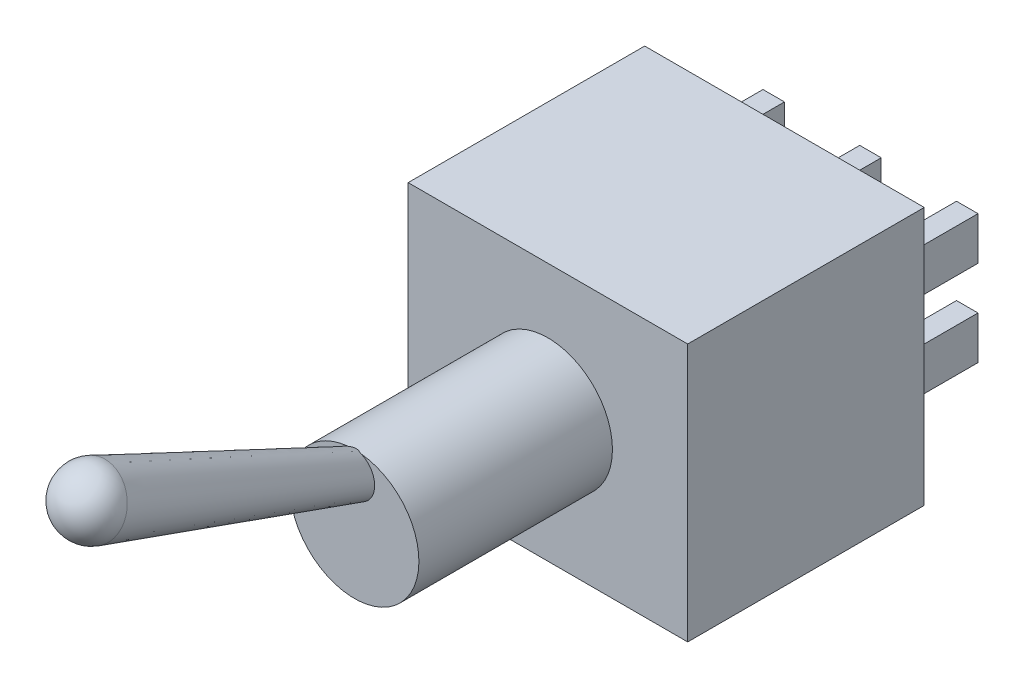
ISO-10303-21;
HEADER;
FILE_DESCRIPTION(('STEP AP214'),'2;1');
FILE_NAME('part.step','',(''),(''),'','','');
FILE_SCHEMA(('AUTOMOTIVE_DESIGN { 1 0 10303 214 1 1 1 1 }'));
ENDSEC;
DATA;
#1=APPLICATION_CONTEXT('core data for automotive mechanical design processes');
#2=APPLICATION_PROTOCOL_DEFINITION('international standard','automotive_design',2000,#1);
#3=PRODUCT_CONTEXT('',#1,'mechanical');
#4=PRODUCT('Part','Part','',(#3));
#5=PRODUCT_RELATED_PRODUCT_CATEGORY('part','',(#4));
#6=PRODUCT_DEFINITION_FORMATION('','',#4);
#7=PRODUCT_DEFINITION_CONTEXT('part definition',#1,'design');
#8=PRODUCT_DEFINITION('design','',#6,#7);
#9=PRODUCT_DEFINITION_SHAPE('','',#8);
#10=(LENGTH_UNIT() NAMED_UNIT(*) SI_UNIT(.MILLI.,.METRE.));
#11=(NAMED_UNIT(*) PLANE_ANGLE_UNIT() SI_UNIT($,.RADIAN.));
#12=(NAMED_UNIT(*) SI_UNIT($,.STERADIAN.) SOLID_ANGLE_UNIT());
#13=UNCERTAINTY_MEASURE_WITH_UNIT(LENGTH_MEASURE(1.E-05),#10,'distance_accuracy_value','');
#14=(GEOMETRIC_REPRESENTATION_CONTEXT(3) GLOBAL_UNCERTAINTY_ASSIGNED_CONTEXT((#13)) GLOBAL_UNIT_ASSIGNED_CONTEXT((#10,
#11,#12)) REPRESENTATION_CONTEXT('',''));
#15=CARTESIAN_POINT('',(0.,0.,0.));
#16=DIRECTION('',(0.,0.,1.));
#17=DIRECTION('',(1.,0.,0.));
#18=AXIS2_PLACEMENT_3D('',#15,#16,#17);
#19=CARTESIAN_POINT('',(-6.5,6.,20.));
#20=DIRECTION('',(0.,0.,-1.));
#21=DIRECTION('',(-1.,0.,0.));
#22=AXIS2_PLACEMENT_3D('',#19,#20,#21);
#23=CYLINDRICAL_SURFACE('',#22,3.);
#24=CARTESIAN_POINT('',(-6.5,6.,11.));
#25=DIRECTION('',(0.,0.,1.));
#26=DIRECTION('',(1.,0.,0.));
#27=AXIS2_PLACEMENT_3D('',#24,#25,#26);
#28=CIRCLE('',#27,3.);
#29=CARTESIAN_POINT('',(-3.5,6.,11.));
#30=VERTEX_POINT('',#29);
#31=EDGE_CURVE('E54',#30,#30,#28,.T.);
#32=ORIENTED_EDGE('',*,*,#31,.T.);
#33=EDGE_LOOP('',(#32));
#34=FACE_BOUND('',#33,.T.);
#35=CARTESIAN_POINT('',(-6.20878339732208,8.98583202647516,20.0002));
#36=CARTESIAN_POINT('',(-6.23815934190393,8.9887111729365,19.9840793561173));
#37=CARTESIAN_POINT('',(-6.26884043857984,8.99125246053167,19.9700978413456));
#38=CARTESIAN_POINT('',(-6.33201689326537,8.99545658639469,19.9471941532919));
#39=CARTESIAN_POINT('',(-6.36450889953132,8.99712099161466,19.9382629531998));
#40=CARTESIAN_POINT('',(-6.43082244543025,8.9993872261203,19.9261410543836));
#41=CARTESIAN_POINT('',(-6.46465085856817,8.99998254377956,19.9229855320874));
#42=CARTESIAN_POINT('',(-6.53232526809802,9.00001669423725,19.9228040432445));
#43=CARTESIAN_POINT('',(-6.5661712647041,8.99945551260329,19.925778153192));
#44=CARTESIAN_POINT('',(-6.63304056204492,8.99723646609102,19.9376430864839));
#45=CARTESIAN_POINT('',(-6.66605416530025,8.99556911931944,19.9465850696067));
#46=CARTESIAN_POINT('',(-6.73023665928067,8.99132938351429,19.969675311725));
#47=CARTESIAN_POINT('',(-6.76140168791821,8.98875517261762,19.9838340536801));
#48=CARTESIAN_POINT('',(-6.79121660269522,8.98583202647347,20.0002000000095));
#49=B_SPLINE_CURVE_WITH_KNOTS('',3,(#35,#36,#37,#38,#39,#40,#41,#42,#43,#44,#45,#46,#47,#48),
.UNSPECIFIED.,.F.,.F.,(4,2,2,2,2,2,4),(0.,0.100936896746004,0.20169280639741,0.303060347749394,
0.404429154113762,0.506678304615884,0.609134053170615),.UNSPECIFIED.);
#50=CARTESIAN_POINT('',(-6.20914959868045,8.98586772045452,20.));
#51=VERTEX_POINT('',#50);
#52=CARTESIAN_POINT('',(-6.79085040131955,8.98586772045452,20.));
#53=VERTEX_POINT('',#52);
#54=EDGE_CURVE('E266',#51,#53,#49,.T.);
#55=ORIENTED_EDGE('',*,*,#54,.F.);
#56=CARTESIAN_POINT('',(-6.5,6.,20.));
#57=DIRECTION('',(0.,0.,1.));
#58=DIRECTION('',(1.,0.,0.));
#59=AXIS2_PLACEMENT_3D('',#56,#57,#58);
#60=CIRCLE('',#59,3.);
#61=EDGE_CURVE('E275',#53,#51,#60,.T.);
#62=ORIENTED_EDGE('',*,*,#61,.F.);
#63=EDGE_LOOP('',(#55,#62));
#64=FACE_BOUND('',#63,.T.);
#65=ADVANCED_FACE('F45',(#34,#64),#23,.T.);
#66=CARTESIAN_POINT('',(0.,0.,11.));
#67=DIRECTION('',(0.,1.,0.));
#68=DIRECTION('',(0.,0.,1.));
#69=AXIS2_PLACEMENT_3D('',#66,#67,#68);
#70=PLANE('',#69);
#71=DIRECTION('',(1.,0.,0.));
#72=VECTOR('',#71,1.);
#73=CARTESIAN_POINT('',(0.,0.,0.));
#74=LINE('',#73,#72);
#75=CARTESIAN_POINT('',(-13.,0.,0.));
#76=VERTEX_POINT('',#75);
#77=CARTESIAN_POINT('',(0.,0.,0.));
#78=VERTEX_POINT('',#77);
#79=EDGE_CURVE('E533',#76,#78,#74,.T.);
#80=ORIENTED_EDGE('',*,*,#79,.T.);
#81=DIRECTION('',(0.,0.,-1.));
#82=VECTOR('',#81,1.);
#83=CARTESIAN_POINT('',(0.,0.,11.));
#84=LINE('',#83,#82);
#85=CARTESIAN_POINT('',(0.,0.,11.));
#86=VERTEX_POINT('',#85);
#87=EDGE_CURVE('E284',#86,#78,#84,.T.);
#88=ORIENTED_EDGE('',*,*,#87,.F.);
#89=DIRECTION('',(1.,0.,0.));
#90=VECTOR('',#89,1.);
#91=CARTESIAN_POINT('',(0.,0.,11.));
#92=LINE('',#91,#90);
#93=CARTESIAN_POINT('',(-13.,0.,11.));
#94=VERTEX_POINT('',#93);
#95=EDGE_CURVE('E545',#94,#86,#92,.T.);
#96=ORIENTED_EDGE('',*,*,#95,.F.);
#97=DIRECTION('',(0.,0.,-1.));
#98=VECTOR('',#97,1.);
#99=CARTESIAN_POINT('',(-13.,0.,11.));
#100=LINE('',#99,#98);
#101=EDGE_CURVE('E559',#94,#76,#100,.T.);
#102=ORIENTED_EDGE('',*,*,#101,.T.);
#103=EDGE_LOOP('',(#80,#88,#96,#102));
#104=FACE_BOUND('',#103,.T.);
#105=ADVANCED_FACE('F47',(#104),#70,.F.);
#106=CARTESIAN_POINT('',(0.,0.,11.));
#107=DIRECTION('',(-1.,0.,0.));
#108=DIRECTION('',(0.,0.,1.));
#109=AXIS2_PLACEMENT_3D('',#106,#107,#108);
#110=PLANE('',#109);
#111=DIRECTION('',(0.,1.,0.));
#112=VECTOR('',#111,1.);
#113=CARTESIAN_POINT('',(0.,0.,0.));
#114=LINE('',#113,#112);
#115=CARTESIAN_POINT('',(0.,12.,0.));
#116=VERTEX_POINT('',#115);
#117=EDGE_CURVE('E563',#78,#116,#114,.T.);
#118=ORIENTED_EDGE('',*,*,#117,.T.);
#119=DIRECTION('',(0.,0.,-1.));
#120=VECTOR('',#119,1.);
#121=CARTESIAN_POINT('',(0.,12.,11.));
#122=LINE('',#121,#120);
#123=CARTESIAN_POINT('',(0.,12.,11.));
#124=VERTEX_POINT('',#123);
#125=EDGE_CURVE('E578',#124,#116,#122,.T.);
#126=ORIENTED_EDGE('',*,*,#125,.F.);
#127=DIRECTION('',(0.,1.,0.));
#128=VECTOR('',#127,1.);
#129=CARTESIAN_POINT('',(0.,0.,11.));
#130=LINE('',#129,#128);
#131=EDGE_CURVE('E549',#86,#124,#130,.T.);
#132=ORIENTED_EDGE('',*,*,#131,.F.);
#133=ORIENTED_EDGE('',*,*,#87,.T.);
#134=EDGE_LOOP('',(#118,#126,#132,#133));
#135=FACE_BOUND('',#134,.T.);
#136=ADVANCED_FACE('F256',(#135),#110,.F.);
#137=CARTESIAN_POINT('',(0.,12.,11.));
#138=DIRECTION('',(0.,-1.,0.));
#139=DIRECTION('',(0.,0.,-1.));
#140=AXIS2_PLACEMENT_3D('',#137,#138,#139);
#141=PLANE('',#140);
#142=DIRECTION('',(-1.,0.,0.));
#143=VECTOR('',#142,1.);
#144=CARTESIAN_POINT('',(0.,12.,0.));
#145=LINE('',#144,#143);
#146=CARTESIAN_POINT('',(-13.,12.,0.));
#147=VERTEX_POINT('',#146);
#148=EDGE_CURVE('E566',#116,#147,#145,.T.);
#149=ORIENTED_EDGE('',*,*,#148,.T.);
#150=DIRECTION('',(0.,0.,-1.));
#151=VECTOR('',#150,1.);
#152=CARTESIAN_POINT('',(-13.,12.,11.));
#153=LINE('',#152,#151);
#154=CARTESIAN_POINT('',(-13.,12.,11.));
#155=VERTEX_POINT('',#154);
#156=EDGE_CURVE('E574',#155,#147,#153,.T.);
#157=ORIENTED_EDGE('',*,*,#156,.F.);
#158=DIRECTION('',(-1.,0.,0.));
#159=VECTOR('',#158,1.);
#160=CARTESIAN_POINT('',(0.,12.,11.));
#161=LINE('',#160,#159);
#162=EDGE_CURVE('E553',#124,#155,#161,.T.);
#163=ORIENTED_EDGE('',*,*,#162,.F.);
#164=ORIENTED_EDGE('',*,*,#125,.T.);
#165=EDGE_LOOP('',(#149,#157,#163,#164));
#166=FACE_BOUND('',#165,.T.);
#167=ADVANCED_FACE('F595',(#166),#141,.F.);
#168=CARTESIAN_POINT('',(-13.,0.,11.));
#169=DIRECTION('',(1.,0.,0.));
#170=DIRECTION('',(0.,0.,-1.));
#171=AXIS2_PLACEMENT_3D('',#168,#169,#170);
#172=PLANE('',#171);
#173=DIRECTION('',(0.,-1.,0.));
#174=VECTOR('',#173,1.);
#175=CARTESIAN_POINT('',(-13.,0.,0.));
#176=LINE('',#175,#174);
#177=EDGE_CURVE('E550',#147,#76,#176,.T.);
#178=ORIENTED_EDGE('',*,*,#177,.T.);
#179=ORIENTED_EDGE('',*,*,#101,.F.);
#180=DIRECTION('',(0.,-1.,0.));
#181=VECTOR('',#180,1.);
#182=CARTESIAN_POINT('',(-13.,0.,11.));
#183=LINE('',#182,#181);
#184=EDGE_CURVE('E556',#155,#94,#183,.T.);
#185=ORIENTED_EDGE('',*,*,#184,.F.);
#186=ORIENTED_EDGE('',*,*,#156,.T.);
#187=EDGE_LOOP('',(#178,#179,#185,#186));
#188=FACE_BOUND('',#187,.T.);
#189=ADVANCED_FACE('F599',(#188),#172,.F.);
#190=CARTESIAN_POINT('',(0.,0.,11.));
#191=DIRECTION('',(0.,0.,-1.));
#192=DIRECTION('',(-1.,0.,0.));
#193=AXIS2_PLACEMENT_3D('',#190,#191,#192);
#194=PLANE('',#193);
#195=ORIENTED_EDGE('',*,*,#31,.F.);
#196=EDGE_LOOP('',(#195));
#197=FACE_BOUND('',#196,.T.);
#198=ORIENTED_EDGE('',*,*,#95,.T.);
#199=ORIENTED_EDGE('',*,*,#131,.T.);
#200=ORIENTED_EDGE('',*,*,#162,.T.);
#201=ORIENTED_EDGE('',*,*,#184,.T.);
#202=EDGE_LOOP('',(#198,#199,#200,#201));
#203=FACE_BOUND('',#202,.T.);
#204=ADVANCED_FACE('F601',(#197,#203),#194,.F.);
#205=CARTESIAN_POINT('',(0.,0.,0.));
#206=DIRECTION('',(0.,0.,-1.));
#207=DIRECTION('',(-1.,0.,0.));
#208=AXIS2_PLACEMENT_3D('',#205,#206,#207);
#209=PLANE('',#208);
#210=DIRECTION('',(1.,0.,0.));
#211=VECTOR('',#210,1.);
#212=CARTESIAN_POINT('',(-2.5,3.,0.));
#213=LINE('',#212,#211);
#214=CARTESIAN_POINT('',(-2.5,3.,0.));
#215=VERTEX_POINT('',#214);
#216=CARTESIAN_POINT('',(-1.5,3.,0.));
#217=VERTEX_POINT('',#216);
#218=EDGE_CURVE('E346',#215,#217,#213,.T.);
#219=ORIENTED_EDGE('',*,*,#218,.T.);
#220=DIRECTION('',(0.,1.,0.));
#221=VECTOR('',#220,1.);
#222=CARTESIAN_POINT('',(-1.5,3.,0.));
#223=LINE('',#222,#221);
#224=CARTESIAN_POINT('',(-1.5,5.,0.));
#225=VERTEX_POINT('',#224);
#226=EDGE_CURVE('E394',#217,#225,#223,.T.);
#227=ORIENTED_EDGE('',*,*,#226,.T.);
#228=DIRECTION('',(-1.,0.,0.));
#229=VECTOR('',#228,1.);
#230=CARTESIAN_POINT('',(-2.5,5.,0.));
#231=LINE('',#230,#229);
#232=CARTESIAN_POINT('',(-2.5,5.,0.));
#233=VERTEX_POINT('',#232);
#234=EDGE_CURVE('E66',#225,#233,#231,.T.);
#235=ORIENTED_EDGE('',*,*,#234,.T.);
#236=DIRECTION('',(0.,-1.,0.));
#237=VECTOR('',#236,1.);
#238=CARTESIAN_POINT('',(-2.5,3.,0.));
#239=LINE('',#238,#237);
#240=EDGE_CURVE('E61',#233,#215,#239,.T.);
#241=ORIENTED_EDGE('',*,*,#240,.T.);
#242=EDGE_LOOP('',(#219,#227,#235,#241));
#243=FACE_BOUND('',#242,.T.);
#244=DIRECTION('',(1.,0.,0.));
#245=VECTOR('',#244,1.);
#246=CARTESIAN_POINT('',(-11.5,7.,0.));
#247=LINE('',#246,#245);
#248=CARTESIAN_POINT('',(-11.5,7.,0.));
#249=VERTEX_POINT('',#248);
#250=CARTESIAN_POINT('',(-10.5,7.,0.));
#251=VERTEX_POINT('',#250);
#252=EDGE_CURVE('E357',#249,#251,#247,.T.);
#253=ORIENTED_EDGE('',*,*,#252,.T.);
#254=DIRECTION('',(0.,1.,0.));
#255=VECTOR('',#254,1.);
#256=CARTESIAN_POINT('',(-10.5,7.,0.));
#257=LINE('',#256,#255);
#258=CARTESIAN_POINT('',(-10.5,9.,0.));
#259=VERTEX_POINT('',#258);
#260=EDGE_CURVE('E354',#251,#259,#257,.T.);
#261=ORIENTED_EDGE('',*,*,#260,.T.);
#262=DIRECTION('',(-1.,0.,0.));
#263=VECTOR('',#262,1.);
#264=CARTESIAN_POINT('',(-11.5,9.,0.));
#265=LINE('',#264,#263);
#266=CARTESIAN_POINT('',(-11.5,9.,0.));
#267=VERTEX_POINT('',#266);
#268=EDGE_CURVE('E350',#259,#267,#265,.T.);
#269=ORIENTED_EDGE('',*,*,#268,.T.);
#270=DIRECTION('',(0.,-1.,0.));
#271=VECTOR('',#270,1.);
#272=CARTESIAN_POINT('',(-11.5,7.,0.));
#273=LINE('',#272,#271);
#274=EDGE_CURVE('E347',#267,#249,#273,.T.);
#275=ORIENTED_EDGE('',*,*,#274,.T.);
#276=EDGE_LOOP('',(#253,#261,#269,#275));
#277=FACE_BOUND('',#276,.T.);
#278=DIRECTION('',(1.,0.,0.));
#279=VECTOR('',#278,1.);
#280=CARTESIAN_POINT('',(-11.5,3.,0.));
#281=LINE('',#280,#279);
#282=CARTESIAN_POINT('',(-11.5,3.,0.));
#283=VERTEX_POINT('',#282);
#284=CARTESIAN_POINT('',(-10.5,3.,0.));
#285=VERTEX_POINT('',#284);
#286=EDGE_CURVE('E430',#283,#285,#281,.T.);
#287=ORIENTED_EDGE('',*,*,#286,.T.);
#288=DIRECTION('',(0.,1.,0.));
#289=VECTOR('',#288,1.);
#290=CARTESIAN_POINT('',(-10.5,3.,0.));
#291=LINE('',#290,#289);
#292=CARTESIAN_POINT('',(-10.5,5.,0.));
#293=VERTEX_POINT('',#292);
#294=EDGE_CURVE('E482',#285,#293,#291,.T.);
#295=ORIENTED_EDGE('',*,*,#294,.T.);
#296=DIRECTION('',(-1.,0.,0.));
#297=VECTOR('',#296,1.);
#298=CARTESIAN_POINT('',(-11.5,5.,0.));
#299=LINE('',#298,#297);
#300=CARTESIAN_POINT('',(-11.5,5.,0.));
#301=VERTEX_POINT('',#300);
#302=EDGE_CURVE('E478',#293,#301,#299,.T.);
#303=ORIENTED_EDGE('',*,*,#302,.T.);
#304=DIRECTION('',(0.,-1.,0.));
#305=VECTOR('',#304,1.);
#306=CARTESIAN_POINT('',(-11.5,3.,0.));
#307=LINE('',#306,#305);
#308=EDGE_CURVE('E475',#301,#283,#307,.T.);
#309=ORIENTED_EDGE('',*,*,#308,.T.);
#310=EDGE_LOOP('',(#287,#295,#303,#309));
#311=FACE_BOUND('',#310,.T.);
#312=DIRECTION('',(1.,0.,0.));
#313=VECTOR('',#312,1.);
#314=CARTESIAN_POINT('',(-7.,7.,0.));
#315=LINE('',#314,#313);
#316=CARTESIAN_POINT('',(-7.,7.,0.));
#317=VERTEX_POINT('',#316);
#318=CARTESIAN_POINT('',(-6.,7.,0.));
#319=VERTEX_POINT('',#318);
#320=EDGE_CURVE('E441',#317,#319,#315,.T.);
#321=ORIENTED_EDGE('',*,*,#320,.T.);
#322=DIRECTION('',(0.,1.,0.));
#323=VECTOR('',#322,1.);
#324=CARTESIAN_POINT('',(-6.,7.,0.));
#325=LINE('',#324,#323);
#326=CARTESIAN_POINT('',(-6.,9.,0.));
#327=VERTEX_POINT('',#326);
#328=EDGE_CURVE('E438',#319,#327,#325,.T.);
#329=ORIENTED_EDGE('',*,*,#328,.T.);
#330=DIRECTION('',(-1.,0.,0.));
#331=VECTOR('',#330,1.);
#332=CARTESIAN_POINT('',(-7.,9.,0.));
#333=LINE('',#332,#331);
#334=CARTESIAN_POINT('',(-7.,9.,0.));
#335=VERTEX_POINT('',#334);
#336=EDGE_CURVE('E434',#327,#335,#333,.T.);
#337=ORIENTED_EDGE('',*,*,#336,.T.);
#338=DIRECTION('',(0.,-1.,0.));
#339=VECTOR('',#338,1.);
#340=CARTESIAN_POINT('',(-7.,7.,0.));
#341=LINE('',#340,#339);
#342=EDGE_CURVE('E431',#335,#317,#341,.T.);
#343=ORIENTED_EDGE('',*,*,#342,.T.);
#344=EDGE_LOOP('',(#321,#329,#337,#343));
#345=FACE_BOUND('',#344,.T.);
#346=DIRECTION('',(1.,0.,0.));
#347=VECTOR('',#346,1.);
#348=CARTESIAN_POINT('',(-2.5,7.,0.));
#349=LINE('',#348,#347);
#350=CARTESIAN_POINT('',(-2.5,7.,0.));
#351=VERTEX_POINT('',#350);
#352=CARTESIAN_POINT('',(-1.5,7.,0.));
#353=VERTEX_POINT('',#352);
#354=EDGE_CURVE('E311',#351,#353,#349,.T.);
#355=ORIENTED_EDGE('',*,*,#354,.T.);
#356=DIRECTION('',(0.,1.,0.));
#357=VECTOR('',#356,1.);
#358=CARTESIAN_POINT('',(-1.5,7.,0.));
#359=LINE('',#358,#357);
#360=CARTESIAN_POINT('',(-1.5,9.,0.));
#361=VERTEX_POINT('',#360);
#362=EDGE_CURVE('E308',#353,#361,#359,.T.);
#363=ORIENTED_EDGE('',*,*,#362,.T.);
#364=DIRECTION('',(-1.,0.,0.));
#365=VECTOR('',#364,1.);
#366=CARTESIAN_POINT('',(-2.5,9.,0.));
#367=LINE('',#366,#365);
#368=CARTESIAN_POINT('',(-2.5,9.,0.));
#369=VERTEX_POINT('',#368);
#370=EDGE_CURVE('E304',#361,#369,#367,.T.);
#371=ORIENTED_EDGE('',*,*,#370,.T.);
#372=DIRECTION('',(0.,-1.,0.));
#373=VECTOR('',#372,1.);
#374=CARTESIAN_POINT('',(-2.5,7.,0.));
#375=LINE('',#374,#373);
#376=EDGE_CURVE('E301',#369,#351,#375,.T.);
#377=ORIENTED_EDGE('',*,*,#376,.T.);
#378=EDGE_LOOP('',(#355,#363,#371,#377));
#379=FACE_BOUND('',#378,.T.);
#380=DIRECTION('',(1.,0.,0.));
#381=VECTOR('',#380,1.);
#382=CARTESIAN_POINT('',(-7.,3.,0.));
#383=LINE('',#382,#381);
#384=CARTESIAN_POINT('',(-7.,3.,0.));
#385=VERTEX_POINT('',#384);
#386=CARTESIAN_POINT('',(-6.,3.,0.));
#387=VERTEX_POINT('',#386);
#388=EDGE_CURVE('E444',#385,#387,#383,.T.);
#389=ORIENTED_EDGE('',*,*,#388,.T.);
#390=DIRECTION('',(0.,1.,0.));
#391=VECTOR('',#390,1.);
#392=CARTESIAN_POINT('',(-6.,3.,0.));
#393=LINE('',#392,#391);
#394=CARTESIAN_POINT('',(-6.,5.,0.));
#395=VERTEX_POINT('',#394);
#396=EDGE_CURVE('E521',#387,#395,#393,.T.);
#397=ORIENTED_EDGE('',*,*,#396,.T.);
#398=DIRECTION('',(-1.,0.,0.));
#399=VECTOR('',#398,1.);
#400=CARTESIAN_POINT('',(-7.,5.,0.));
#401=LINE('',#400,#399);
#402=CARTESIAN_POINT('',(-7.,5.,0.));
#403=VERTEX_POINT('',#402);
#404=EDGE_CURVE('E524',#395,#403,#401,.T.);
#405=ORIENTED_EDGE('',*,*,#404,.T.);
#406=DIRECTION('',(0.,-1.,0.));
#407=VECTOR('',#406,1.);
#408=CARTESIAN_POINT('',(-7.,3.,0.));
#409=LINE('',#408,#407);
#410=EDGE_CURVE('E506',#403,#385,#409,.T.);
#411=ORIENTED_EDGE('',*,*,#410,.T.);
#412=EDGE_LOOP('',(#389,#397,#405,#411));
#413=FACE_BOUND('',#412,.T.);
#414=ORIENTED_EDGE('',*,*,#79,.F.);
#415=ORIENTED_EDGE('',*,*,#177,.F.);
#416=ORIENTED_EDGE('',*,*,#148,.F.);
#417=ORIENTED_EDGE('',*,*,#117,.F.);
#418=EDGE_LOOP('',(#414,#415,#416,#417));
#419=FACE_BOUND('',#418,.T.);
#420=ADVANCED_FACE('F591',(#243,#277,#311,#345,#379,#413,#419),#209,.T.);
#421=CARTESIAN_POINT('',(-7.,3.,-4.));
#422=DIRECTION('',(0.,-1.,0.));
#423=DIRECTION('',(0.,0.,-1.));
#424=AXIS2_PLACEMENT_3D('',#421,#422,#423);
#425=PLANE('',#424);
#426=ORIENTED_EDGE('',*,*,#388,.F.);
#427=DIRECTION('',(0.,0.,1.));
#428=VECTOR('',#427,1.);
#429=CARTESIAN_POINT('',(-7.,3.,-4.));
#430=LINE('',#429,#428);
#431=CARTESIAN_POINT('',(-7.,3.,-4.));
#432=VERTEX_POINT('',#431);
#433=EDGE_CURVE('E529',#432,#385,#430,.T.);
#434=ORIENTED_EDGE('',*,*,#433,.F.);
#435=DIRECTION('',(1.,0.,0.));
#436=VECTOR('',#435,1.);
#437=CARTESIAN_POINT('',(-7.,3.,-4.));
#438=LINE('',#437,#436);
#439=CARTESIAN_POINT('',(-6.,3.,-4.));
#440=VERTEX_POINT('',#439);
#441=EDGE_CURVE('E501',#432,#440,#438,.T.);
#442=ORIENTED_EDGE('',*,*,#441,.T.);
#443=DIRECTION('',(0.,0.,1.));
#444=VECTOR('',#443,1.);
#445=CARTESIAN_POINT('',(-6.,3.,-4.));
#446=LINE('',#445,#444);
#447=EDGE_CURVE('E518',#440,#387,#446,.T.);
#448=ORIENTED_EDGE('',*,*,#447,.T.);
#449=EDGE_LOOP('',(#426,#434,#442,#448));
#450=FACE_BOUND('',#449,.T.);
#451=ADVANCED_FACE('F608',(#450),#425,.T.);
#452=CARTESIAN_POINT('',(-7.,3.,-4.));
#453=DIRECTION('',(-1.,0.,0.));
#454=DIRECTION('',(0.,-1.,0.));
#455=AXIS2_PLACEMENT_3D('',#452,#453,#454);
#456=PLANE('',#455);
#457=ORIENTED_EDGE('',*,*,#410,.F.);
#458=DIRECTION('',(0.,0.,1.));
#459=VECTOR('',#458,1.);
#460=CARTESIAN_POINT('',(-7.,5.,-4.));
#461=LINE('',#460,#459);
#462=CARTESIAN_POINT('',(-7.,5.,-4.));
#463=VERTEX_POINT('',#462);
#464=EDGE_CURVE('E534',#463,#403,#461,.T.);
#465=ORIENTED_EDGE('',*,*,#464,.F.);
#466=DIRECTION('',(0.,-1.,0.));
#467=VECTOR('',#466,1.);
#468=CARTESIAN_POINT('',(-7.,3.,-4.));
#469=LINE('',#468,#467);
#470=EDGE_CURVE('E514',#463,#432,#469,.T.);
#471=ORIENTED_EDGE('',*,*,#470,.T.);
#472=ORIENTED_EDGE('',*,*,#433,.T.);
#473=EDGE_LOOP('',(#457,#465,#471,#472));
#474=FACE_BOUND('',#473,.T.);
#475=ADVANCED_FACE('F644',(#474),#456,.T.);
#476=CARTESIAN_POINT('',(-7.,5.,-4.));
#477=DIRECTION('',(0.,1.,0.));
#478=DIRECTION('',(0.,0.,1.));
#479=AXIS2_PLACEMENT_3D('',#476,#477,#478);
#480=PLANE('',#479);
#481=ORIENTED_EDGE('',*,*,#404,.F.);
#482=DIRECTION('',(0.,0.,1.));
#483=VECTOR('',#482,1.);
#484=CARTESIAN_POINT('',(-6.,5.,-4.));
#485=LINE('',#484,#483);
#486=CARTESIAN_POINT('',(-6.,5.,-4.));
#487=VERTEX_POINT('',#486);
#488=EDGE_CURVE('E538',#487,#395,#485,.T.);
#489=ORIENTED_EDGE('',*,*,#488,.F.);
#490=DIRECTION('',(-1.,0.,0.));
#491=VECTOR('',#490,1.);
#492=CARTESIAN_POINT('',(-7.,5.,-4.));
#493=LINE('',#492,#491);
#494=EDGE_CURVE('E510',#487,#463,#493,.T.);
#495=ORIENTED_EDGE('',*,*,#494,.T.);
#496=ORIENTED_EDGE('',*,*,#464,.T.);
#497=EDGE_LOOP('',(#481,#489,#495,#496));
#498=FACE_BOUND('',#497,.T.);
#499=ADVANCED_FACE('F652',(#498),#480,.T.);
#500=CARTESIAN_POINT('',(-6.,3.,-4.));
#501=DIRECTION('',(1.,0.,0.));
#502=DIRECTION('',(0.,0.,-1.));
#503=AXIS2_PLACEMENT_3D('',#500,#501,#502);
#504=PLANE('',#503);
#505=ORIENTED_EDGE('',*,*,#396,.F.);
#506=ORIENTED_EDGE('',*,*,#447,.F.);
#507=DIRECTION('',(0.,1.,0.));
#508=VECTOR('',#507,1.);
#509=CARTESIAN_POINT('',(-6.,3.,-4.));
#510=LINE('',#509,#508);
#511=EDGE_CURVE('E505',#440,#487,#510,.T.);
#512=ORIENTED_EDGE('',*,*,#511,.T.);
#513=ORIENTED_EDGE('',*,*,#488,.T.);
#514=EDGE_LOOP('',(#505,#506,#512,#513));
#515=FACE_BOUND('',#514,.T.);
#516=ADVANCED_FACE('F661',(#515),#504,.T.);
#517=CARTESIAN_POINT('',(0.,0.,-4.));
#518=DIRECTION('',(0.,0.,1.));
#519=DIRECTION('',(1.,0.,0.));
#520=AXIS2_PLACEMENT_3D('',#517,#518,#519);
#521=PLANE('',#520);
#522=ORIENTED_EDGE('',*,*,#441,.F.);
#523=ORIENTED_EDGE('',*,*,#470,.F.);
#524=ORIENTED_EDGE('',*,*,#494,.F.);
#525=ORIENTED_EDGE('',*,*,#511,.F.);
#526=EDGE_LOOP('',(#522,#523,#524,#525));
#527=FACE_BOUND('',#526,.T.);
#528=ADVANCED_FACE('F670',(#527),#521,.F.);
#529=CARTESIAN_POINT('',(-2.5,7.,-4.));
#530=DIRECTION('',(0.,-1.,0.));
#531=DIRECTION('',(0.,0.,-1.));
#532=AXIS2_PLACEMENT_3D('',#529,#530,#531);
#533=PLANE('',#532);
#534=ORIENTED_EDGE('',*,*,#354,.F.);
#535=DIRECTION('',(0.,0.,1.));
#536=VECTOR('',#535,1.);
#537=CARTESIAN_POINT('',(-2.5,7.,-4.));
#538=LINE('',#537,#536);
#539=CARTESIAN_POINT('',(-2.5,7.,-4.));
#540=VERTEX_POINT('',#539);
#541=EDGE_CURVE('E281',#540,#351,#538,.T.);
#542=ORIENTED_EDGE('',*,*,#541,.F.);
#543=DIRECTION('',(1.,0.,0.));
#544=VECTOR('',#543,1.);
#545=CARTESIAN_POINT('',(-2.5,7.,-4.));
#546=LINE('',#545,#544);
#547=CARTESIAN_POINT('',(-1.5,7.,-4.));
#548=VERTEX_POINT('',#547);
#549=EDGE_CURVE('E305',#540,#548,#546,.T.);
#550=ORIENTED_EDGE('',*,*,#549,.T.);
#551=DIRECTION('',(0.,0.,1.));
#552=VECTOR('',#551,1.);
#553=CARTESIAN_POINT('',(-1.5,7.,-4.));
#554=LINE('',#553,#552);
#555=EDGE_CURVE('E285',#548,#353,#554,.T.);
#556=ORIENTED_EDGE('',*,*,#555,.T.);
#557=EDGE_LOOP('',(#534,#542,#550,#556));
#558=FACE_BOUND('',#557,.T.);
#559=ADVANCED_FACE('F263',(#558),#533,.T.);
#560=CARTESIAN_POINT('',(-2.5,7.,-4.));
#561=DIRECTION('',(-1.,0.,0.));
#562=DIRECTION('',(0.,-1.,0.));
#563=AXIS2_PLACEMENT_3D('',#560,#561,#562);
#564=PLANE('',#563);
#565=ORIENTED_EDGE('',*,*,#376,.F.);
#566=DIRECTION('',(0.,0.,1.));
#567=VECTOR('',#566,1.);
#568=CARTESIAN_POINT('',(-2.5,9.,-4.));
#569=LINE('',#568,#567);
#570=CARTESIAN_POINT('',(-2.5,9.,-4.));
#571=VERTEX_POINT('',#570);
#572=EDGE_CURVE('E294',#571,#369,#569,.T.);
#573=ORIENTED_EDGE('',*,*,#572,.F.);
#574=DIRECTION('',(0.,-1.,0.));
#575=VECTOR('',#574,1.);
#576=CARTESIAN_POINT('',(-2.5,7.,-4.));
#577=LINE('',#576,#575);
#578=EDGE_CURVE('E289',#571,#540,#577,.T.);
#579=ORIENTED_EDGE('',*,*,#578,.T.);
#580=ORIENTED_EDGE('',*,*,#541,.T.);
#581=EDGE_LOOP('',(#565,#573,#579,#580));
#582=FACE_BOUND('',#581,.T.);
#583=ADVANCED_FACE('F686',(#582),#564,.T.);
#584=CARTESIAN_POINT('',(-2.5,9.,-4.));
#585=DIRECTION('',(0.,1.,0.));
#586=DIRECTION('',(0.,0.,1.));
#587=AXIS2_PLACEMENT_3D('',#584,#585,#586);
#588=PLANE('',#587);
#589=ORIENTED_EDGE('',*,*,#370,.F.);
#590=DIRECTION('',(0.,0.,1.));
#591=VECTOR('',#590,1.);
#592=CARTESIAN_POINT('',(-1.5,9.,-4.));
#593=LINE('',#592,#591);
#594=CARTESIAN_POINT('',(-1.5,9.,-4.));
#595=VERTEX_POINT('',#594);
#596=EDGE_CURVE('E290',#595,#361,#593,.T.);
#597=ORIENTED_EDGE('',*,*,#596,.F.);
#598=DIRECTION('',(-1.,0.,0.));
#599=VECTOR('',#598,1.);
#600=CARTESIAN_POINT('',(-2.5,9.,-4.));
#601=LINE('',#600,#599);
#602=EDGE_CURVE('E318',#595,#571,#601,.T.);
#603=ORIENTED_EDGE('',*,*,#602,.T.);
#604=ORIENTED_EDGE('',*,*,#572,.T.);
#605=EDGE_LOOP('',(#589,#597,#603,#604));
#606=FACE_BOUND('',#605,.T.);
#607=ADVANCED_FACE('F694',(#606),#588,.T.);
#608=CARTESIAN_POINT('',(-1.5,7.,-4.));
#609=DIRECTION('',(1.,0.,0.));
#610=DIRECTION('',(0.,0.,-1.));
#611=AXIS2_PLACEMENT_3D('',#608,#609,#610);
#612=PLANE('',#611);
#613=ORIENTED_EDGE('',*,*,#362,.F.);
#614=ORIENTED_EDGE('',*,*,#555,.F.);
#615=DIRECTION('',(0.,1.,0.));
#616=VECTOR('',#615,1.);
#617=CARTESIAN_POINT('',(-1.5,7.,-4.));
#618=LINE('',#617,#616);
#619=EDGE_CURVE('E322',#548,#595,#618,.T.);
#620=ORIENTED_EDGE('',*,*,#619,.T.);
#621=ORIENTED_EDGE('',*,*,#596,.T.);
#622=EDGE_LOOP('',(#613,#614,#620,#621));
#623=FACE_BOUND('',#622,.T.);
#624=ADVANCED_FACE('F703',(#623),#612,.T.);
#625=CARTESIAN_POINT('',(0.,0.,-4.));
#626=DIRECTION('',(0.,0.,1.));
#627=DIRECTION('',(1.,0.,0.));
#628=AXIS2_PLACEMENT_3D('',#625,#626,#627);
#629=PLANE('',#628);
#630=ORIENTED_EDGE('',*,*,#549,.F.);
#631=ORIENTED_EDGE('',*,*,#578,.F.);
#632=ORIENTED_EDGE('',*,*,#602,.F.);
#633=ORIENTED_EDGE('',*,*,#619,.F.);
#634=EDGE_LOOP('',(#630,#631,#632,#633));
#635=FACE_BOUND('',#634,.T.);
#636=ADVANCED_FACE('F712',(#635),#629,.F.);
#637=CARTESIAN_POINT('',(-7.,7.,-4.));
#638=DIRECTION('',(0.,-1.,0.));
#639=DIRECTION('',(0.,0.,-1.));
#640=AXIS2_PLACEMENT_3D('',#637,#638,#639);
#641=PLANE('',#640);
#642=ORIENTED_EDGE('',*,*,#320,.F.);
#643=DIRECTION('',(0.,0.,1.));
#644=VECTOR('',#643,1.);
#645=CARTESIAN_POINT('',(-7.,7.,-4.));
#646=LINE('',#645,#644);
#647=CARTESIAN_POINT('',(-7.,7.,-4.));
#648=VERTEX_POINT('',#647);
#649=EDGE_CURVE('E426',#648,#317,#646,.T.);
#650=ORIENTED_EDGE('',*,*,#649,.F.);
#651=DIRECTION('',(1.,0.,0.));
#652=VECTOR('',#651,1.);
#653=CARTESIAN_POINT('',(-7.,7.,-4.));
#654=LINE('',#653,#652);
#655=CARTESIAN_POINT('',(-6.,7.,-4.));
#656=VERTEX_POINT('',#655);
#657=EDGE_CURVE('E435',#648,#656,#654,.T.);
#658=ORIENTED_EDGE('',*,*,#657,.T.);
#659=DIRECTION('',(0.,0.,1.));
#660=VECTOR('',#659,1.);
#661=CARTESIAN_POINT('',(-6.,7.,-4.));
#662=LINE('',#661,#660);
#663=EDGE_CURVE('E413',#656,#319,#662,.T.);
#664=ORIENTED_EDGE('',*,*,#663,.T.);
#665=EDGE_LOOP('',(#642,#650,#658,#664));
#666=FACE_BOUND('',#665,.T.);
#667=ADVANCED_FACE('F720',(#666),#641,.T.);
#668=CARTESIAN_POINT('',(-7.,7.,-4.));
#669=DIRECTION('',(-1.,0.,0.));
#670=DIRECTION('',(0.,0.,1.));
#671=AXIS2_PLACEMENT_3D('',#668,#669,#670);
#672=PLANE('',#671);
#673=ORIENTED_EDGE('',*,*,#342,.F.);
#674=DIRECTION('',(0.,0.,1.));
#675=VECTOR('',#674,1.);
#676=CARTESIAN_POINT('',(-7.,9.,-4.));
#677=LINE('',#676,#675);
#678=CARTESIAN_POINT('',(-7.,9.,-4.));
#679=VERTEX_POINT('',#678);
#680=EDGE_CURVE('E422',#679,#335,#677,.T.);
#681=ORIENTED_EDGE('',*,*,#680,.F.);
#682=DIRECTION('',(0.,-1.,0.));
#683=VECTOR('',#682,1.);
#684=CARTESIAN_POINT('',(-7.,7.,-4.));
#685=LINE('',#684,#683);
#686=EDGE_CURVE('E417',#679,#648,#685,.T.);
#687=ORIENTED_EDGE('',*,*,#686,.T.);
#688=ORIENTED_EDGE('',*,*,#649,.T.);
#689=EDGE_LOOP('',(#673,#681,#687,#688));
#690=FACE_BOUND('',#689,.T.);
#691=ADVANCED_FACE('F729',(#690),#672,.T.);
#692=CARTESIAN_POINT('',(-7.,9.,-4.));
#693=DIRECTION('',(0.,1.,0.));
#694=DIRECTION('',(0.,0.,1.));
#695=AXIS2_PLACEMENT_3D('',#692,#693,#694);
#696=PLANE('',#695);
#697=ORIENTED_EDGE('',*,*,#336,.F.);
#698=DIRECTION('',(0.,0.,1.));
#699=VECTOR('',#698,1.);
#700=CARTESIAN_POINT('',(-6.,9.,-4.));
#701=LINE('',#700,#699);
#702=CARTESIAN_POINT('',(-6.,9.,-4.));
#703=VERTEX_POINT('',#702);
#704=EDGE_CURVE('E418',#703,#327,#701,.T.);
#705=ORIENTED_EDGE('',*,*,#704,.F.);
#706=DIRECTION('',(-1.,0.,0.));
#707=VECTOR('',#706,1.);
#708=CARTESIAN_POINT('',(-7.,9.,-4.));
#709=LINE('',#708,#707);
#710=EDGE_CURVE('E448',#703,#679,#709,.T.);
#711=ORIENTED_EDGE('',*,*,#710,.T.);
#712=ORIENTED_EDGE('',*,*,#680,.T.);
#713=EDGE_LOOP('',(#697,#705,#711,#712));
#714=FACE_BOUND('',#713,.T.);
#715=ADVANCED_FACE('F738',(#714),#696,.T.);
#716=CARTESIAN_POINT('',(-6.,7.,-4.));
#717=DIRECTION('',(1.,0.,0.));
#718=DIRECTION('',(0.,0.,-1.));
#719=AXIS2_PLACEMENT_3D('',#716,#717,#718);
#720=PLANE('',#719);
#721=ORIENTED_EDGE('',*,*,#328,.F.);
#722=ORIENTED_EDGE('',*,*,#663,.F.);
#723=DIRECTION('',(0.,1.,0.));
#724=VECTOR('',#723,1.);
#725=CARTESIAN_POINT('',(-6.,7.,-4.));
#726=LINE('',#725,#724);
#727=EDGE_CURVE('E452',#656,#703,#726,.T.);
#728=ORIENTED_EDGE('',*,*,#727,.T.);
#729=ORIENTED_EDGE('',*,*,#704,.T.);
#730=EDGE_LOOP('',(#721,#722,#728,#729));
#731=FACE_BOUND('',#730,.T.);
#732=ADVANCED_FACE('F747',(#731),#720,.T.);
#733=CARTESIAN_POINT('',(0.,0.,-4.));
#734=DIRECTION('',(0.,0.,1.));
#735=DIRECTION('',(1.,0.,0.));
#736=AXIS2_PLACEMENT_3D('',#733,#734,#735);
#737=PLANE('',#736);
#738=ORIENTED_EDGE('',*,*,#657,.F.);
#739=ORIENTED_EDGE('',*,*,#686,.F.);
#740=ORIENTED_EDGE('',*,*,#710,.F.);
#741=ORIENTED_EDGE('',*,*,#727,.F.);
#742=EDGE_LOOP('',(#738,#739,#740,#741));
#743=FACE_BOUND('',#742,.T.);
#744=ADVANCED_FACE('F756',(#743),#737,.F.);
#745=CARTESIAN_POINT('',(-11.5,3.,-4.));
#746=DIRECTION('',(0.,-1.,0.));
#747=DIRECTION('',(1.,0.,0.));
#748=AXIS2_PLACEMENT_3D('',#745,#746,#747);
#749=PLANE('',#748);
#750=ORIENTED_EDGE('',*,*,#286,.F.);
#751=DIRECTION('',(0.,0.,1.));
#752=VECTOR('',#751,1.);
#753=CARTESIAN_POINT('',(-11.5,3.,-4.));
#754=LINE('',#753,#752);
#755=CARTESIAN_POINT('',(-11.5,3.,-4.));
#756=VERTEX_POINT('',#755);
#757=EDGE_CURVE('E360',#756,#283,#754,.T.);
#758=ORIENTED_EDGE('',*,*,#757,.F.);
#759=DIRECTION('',(1.,0.,0.));
#760=VECTOR('',#759,1.);
#761=CARTESIAN_POINT('',(-11.5,3.,-4.));
#762=LINE('',#761,#760);
#763=CARTESIAN_POINT('',(-10.5,3.,-4.));
#764=VERTEX_POINT('',#763);
#765=EDGE_CURVE('E479',#756,#764,#762,.T.);
#766=ORIENTED_EDGE('',*,*,#765,.T.);
#767=DIRECTION('',(0.,0.,1.));
#768=VECTOR('',#767,1.);
#769=CARTESIAN_POINT('',(-10.5,3.,-4.));
#770=LINE('',#769,#768);
#771=EDGE_CURVE('E459',#764,#285,#770,.T.);
#772=ORIENTED_EDGE('',*,*,#771,.T.);
#773=EDGE_LOOP('',(#750,#758,#766,#772));
#774=FACE_BOUND('',#773,.T.);
#775=ADVANCED_FACE('F765',(#774),#749,.T.);
#776=CARTESIAN_POINT('',(-11.5,3.,-4.));
#777=DIRECTION('',(-1.,0.,0.));
#778=DIRECTION('',(0.,0.,1.));
#779=AXIS2_PLACEMENT_3D('',#776,#777,#778);
#780=PLANE('',#779);
#781=ORIENTED_EDGE('',*,*,#308,.F.);
#782=DIRECTION('',(0.,0.,1.));
#783=VECTOR('',#782,1.);
#784=CARTESIAN_POINT('',(-11.5,5.,-4.));
#785=LINE('',#784,#783);
#786=CARTESIAN_POINT('',(-11.5,5.,-4.));
#787=VERTEX_POINT('',#786);
#788=EDGE_CURVE('E468',#787,#301,#785,.T.);
#789=ORIENTED_EDGE('',*,*,#788,.F.);
#790=DIRECTION('',(0.,-1.,0.));
#791=VECTOR('',#790,1.);
#792=CARTESIAN_POINT('',(-11.5,3.,-4.));
#793=LINE('',#792,#791);
#794=EDGE_CURVE('E463',#787,#756,#793,.T.);
#795=ORIENTED_EDGE('',*,*,#794,.T.);
#796=ORIENTED_EDGE('',*,*,#757,.T.);
#797=EDGE_LOOP('',(#781,#789,#795,#796));
#798=FACE_BOUND('',#797,.T.);
#799=ADVANCED_FACE('F774',(#798),#780,.T.);
#800=CARTESIAN_POINT('',(-11.5,5.,-4.));
#801=DIRECTION('',(0.,1.,0.));
#802=DIRECTION('',(0.,0.,1.));
#803=AXIS2_PLACEMENT_3D('',#800,#801,#802);
#804=PLANE('',#803);
#805=ORIENTED_EDGE('',*,*,#302,.F.);
#806=DIRECTION('',(0.,0.,1.));
#807=VECTOR('',#806,1.);
#808=CARTESIAN_POINT('',(-10.5,5.,-4.));
#809=LINE('',#808,#807);
#810=CARTESIAN_POINT('',(-10.5,5.,-4.));
#811=VERTEX_POINT('',#810);
#812=EDGE_CURVE('E464',#811,#293,#809,.T.);
#813=ORIENTED_EDGE('',*,*,#812,.F.);
#814=DIRECTION('',(-1.,0.,0.));
#815=VECTOR('',#814,1.);
#816=CARTESIAN_POINT('',(-11.5,5.,-4.));
#817=LINE('',#816,#815);
#818=EDGE_CURVE('E490',#811,#787,#817,.T.);
#819=ORIENTED_EDGE('',*,*,#818,.T.);
#820=ORIENTED_EDGE('',*,*,#788,.T.);
#821=EDGE_LOOP('',(#805,#813,#819,#820));
#822=FACE_BOUND('',#821,.T.);
#823=ADVANCED_FACE('F783',(#822),#804,.T.);
#824=CARTESIAN_POINT('',(-10.5,3.,-4.));
#825=DIRECTION('',(1.,0.,0.));
#826=DIRECTION('',(0.,0.,-1.));
#827=AXIS2_PLACEMENT_3D('',#824,#825,#826);
#828=PLANE('',#827);
#829=ORIENTED_EDGE('',*,*,#294,.F.);
#830=ORIENTED_EDGE('',*,*,#771,.F.);
#831=DIRECTION('',(0.,1.,0.));
#832=VECTOR('',#831,1.);
#833=CARTESIAN_POINT('',(-10.5,3.,-4.));
#834=LINE('',#833,#832);
#835=EDGE_CURVE('E494',#764,#811,#834,.T.);
#836=ORIENTED_EDGE('',*,*,#835,.T.);
#837=ORIENTED_EDGE('',*,*,#812,.T.);
#838=EDGE_LOOP('',(#829,#830,#836,#837));
#839=FACE_BOUND('',#838,.T.);
#840=ADVANCED_FACE('F792',(#839),#828,.T.);
#841=CARTESIAN_POINT('',(0.,0.,-4.));
#842=DIRECTION('',(0.,0.,1.));
#843=DIRECTION('',(1.,0.,0.));
#844=AXIS2_PLACEMENT_3D('',#841,#842,#843);
#845=PLANE('',#844);
#846=ORIENTED_EDGE('',*,*,#765,.F.);
#847=ORIENTED_EDGE('',*,*,#794,.F.);
#848=ORIENTED_EDGE('',*,*,#818,.F.);
#849=ORIENTED_EDGE('',*,*,#835,.F.);
#850=EDGE_LOOP('',(#846,#847,#848,#849));
#851=FACE_BOUND('',#850,.T.);
#852=ADVANCED_FACE('F801',(#851),#845,.F.);
#853=CARTESIAN_POINT('',(-11.5,7.,-4.));
#854=DIRECTION('',(0.,-1.,0.));
#855=DIRECTION('',(1.,0.,0.));
#856=AXIS2_PLACEMENT_3D('',#853,#854,#855);
#857=PLANE('',#856);
#858=ORIENTED_EDGE('',*,*,#252,.F.);
#859=DIRECTION('',(0.,0.,1.));
#860=VECTOR('',#859,1.);
#861=CARTESIAN_POINT('',(-11.5,7.,-4.));
#862=LINE('',#861,#860);
#863=CARTESIAN_POINT('',(-11.5,7.,-4.));
#864=VERTEX_POINT('',#863);
#865=EDGE_CURVE('E342',#864,#249,#862,.T.);
#866=ORIENTED_EDGE('',*,*,#865,.F.);
#867=DIRECTION('',(1.,0.,0.));
#868=VECTOR('',#867,1.);
#869=CARTESIAN_POINT('',(-11.5,7.,-4.));
#870=LINE('',#869,#868);
#871=CARTESIAN_POINT('',(-10.5,7.,-4.));
#872=VERTEX_POINT('',#871);
#873=EDGE_CURVE('E351',#864,#872,#870,.T.);
#874=ORIENTED_EDGE('',*,*,#873,.T.);
#875=DIRECTION('',(0.,0.,1.));
#876=VECTOR('',#875,1.);
#877=CARTESIAN_POINT('',(-10.5,7.,-4.));
#878=LINE('',#877,#876);
#879=EDGE_CURVE('E329',#872,#251,#878,.T.);
#880=ORIENTED_EDGE('',*,*,#879,.T.);
#881=EDGE_LOOP('',(#858,#866,#874,#880));
#882=FACE_BOUND('',#881,.T.);
#883=ADVANCED_FACE('F810',(#882),#857,.T.);
#884=CARTESIAN_POINT('',(-11.5,7.,-4.));
#885=DIRECTION('',(-1.,0.,0.));
#886=DIRECTION('',(0.,0.,1.));
#887=AXIS2_PLACEMENT_3D('',#884,#885,#886);
#888=PLANE('',#887);
#889=ORIENTED_EDGE('',*,*,#274,.F.);
#890=DIRECTION('',(0.,0.,1.));
#891=VECTOR('',#890,1.);
#892=CARTESIAN_POINT('',(-11.5,9.,-4.));
#893=LINE('',#892,#891);
#894=CARTESIAN_POINT('',(-11.5,9.,-4.));
#895=VERTEX_POINT('',#894);
#896=EDGE_CURVE('E338',#895,#267,#893,.T.);
#897=ORIENTED_EDGE('',*,*,#896,.F.);
#898=DIRECTION('',(0.,-1.,0.));
#899=VECTOR('',#898,1.);
#900=CARTESIAN_POINT('',(-11.5,7.,-4.));
#901=LINE('',#900,#899);
#902=EDGE_CURVE('E333',#895,#864,#901,.T.);
#903=ORIENTED_EDGE('',*,*,#902,.T.);
#904=ORIENTED_EDGE('',*,*,#865,.T.);
#905=EDGE_LOOP('',(#889,#897,#903,#904));
#906=FACE_BOUND('',#905,.T.);
#907=ADVANCED_FACE('F819',(#906),#888,.T.);
#908=CARTESIAN_POINT('',(-11.5,9.,-4.));
#909=DIRECTION('',(0.,1.,0.));
#910=DIRECTION('',(0.,0.,1.));
#911=AXIS2_PLACEMENT_3D('',#908,#909,#910);
#912=PLANE('',#911);
#913=ORIENTED_EDGE('',*,*,#268,.F.);
#914=DIRECTION('',(0.,0.,1.));
#915=VECTOR('',#914,1.);
#916=CARTESIAN_POINT('',(-10.5,9.,-4.));
#917=LINE('',#916,#915);
#918=CARTESIAN_POINT('',(-10.5,9.,-4.));
#919=VERTEX_POINT('',#918);
#920=EDGE_CURVE('E334',#919,#259,#917,.T.);
#921=ORIENTED_EDGE('',*,*,#920,.F.);
#922=DIRECTION('',(-1.,0.,0.));
#923=VECTOR('',#922,1.);
#924=CARTESIAN_POINT('',(-11.5,9.,-4.));
#925=LINE('',#924,#923);
#926=EDGE_CURVE('E364',#919,#895,#925,.T.);
#927=ORIENTED_EDGE('',*,*,#926,.T.);
#928=ORIENTED_EDGE('',*,*,#896,.T.);
#929=EDGE_LOOP('',(#913,#921,#927,#928));
#930=FACE_BOUND('',#929,.T.);
#931=ADVANCED_FACE('F828',(#930),#912,.T.);
#932=CARTESIAN_POINT('',(-10.5,7.,-4.));
#933=DIRECTION('',(1.,0.,0.));
#934=DIRECTION('',(0.,0.,-1.));
#935=AXIS2_PLACEMENT_3D('',#932,#933,#934);
#936=PLANE('',#935);
#937=ORIENTED_EDGE('',*,*,#260,.F.);
#938=ORIENTED_EDGE('',*,*,#879,.F.);
#939=DIRECTION('',(0.,1.,0.));
#940=VECTOR('',#939,1.);
#941=CARTESIAN_POINT('',(-10.5,7.,-4.));
#942=LINE('',#941,#940);
#943=EDGE_CURVE('E368',#872,#919,#942,.T.);
#944=ORIENTED_EDGE('',*,*,#943,.T.);
#945=ORIENTED_EDGE('',*,*,#920,.T.);
#946=EDGE_LOOP('',(#937,#938,#944,#945));
#947=FACE_BOUND('',#946,.T.);
#948=ADVANCED_FACE('F837',(#947),#936,.T.);
#949=CARTESIAN_POINT('',(0.,0.,-4.));
#950=DIRECTION('',(0.,0.,1.));
#951=DIRECTION('',(1.,0.,0.));
#952=AXIS2_PLACEMENT_3D('',#949,#950,#951);
#953=PLANE('',#952);
#954=ORIENTED_EDGE('',*,*,#873,.F.);
#955=ORIENTED_EDGE('',*,*,#902,.F.);
#956=ORIENTED_EDGE('',*,*,#926,.F.);
#957=ORIENTED_EDGE('',*,*,#943,.F.);
#958=EDGE_LOOP('',(#954,#955,#956,#957));
#959=FACE_BOUND('',#958,.T.);
#960=ADVANCED_FACE('F846',(#959),#953,.F.);
#961=CARTESIAN_POINT('',(-2.5,3.,-4.));
#962=DIRECTION('',(0.,-1.,0.));
#963=DIRECTION('',(0.,0.,-1.));
#964=AXIS2_PLACEMENT_3D('',#961,#962,#963);
#965=PLANE('',#964);
#966=ORIENTED_EDGE('',*,*,#218,.F.);
#967=DIRECTION('',(0.,0.,1.));
#968=VECTOR('',#967,1.);
#969=CARTESIAN_POINT('',(-2.5,3.,-4.));
#970=LINE('',#969,#968);
#971=CARTESIAN_POINT('',(-2.5,3.,-4.));
#972=VERTEX_POINT('',#971);
#973=EDGE_CURVE('E314',#972,#215,#970,.T.);
#974=ORIENTED_EDGE('',*,*,#973,.F.);
#975=DIRECTION('',(1.,0.,0.));
#976=VECTOR('',#975,1.);
#977=CARTESIAN_POINT('',(-2.5,3.,-4.));
#978=LINE('',#977,#976);
#979=CARTESIAN_POINT('',(-1.5,3.,-4.));
#980=VERTEX_POINT('',#979);
#981=EDGE_CURVE('E391',#972,#980,#978,.T.);
#982=ORIENTED_EDGE('',*,*,#981,.T.);
#983=DIRECTION('',(0.,0.,1.));
#984=VECTOR('',#983,1.);
#985=CARTESIAN_POINT('',(-1.5,3.,-4.));
#986=LINE('',#985,#984);
#987=EDGE_CURVE('E375',#980,#217,#986,.T.);
#988=ORIENTED_EDGE('',*,*,#987,.T.);
#989=EDGE_LOOP('',(#966,#974,#982,#988));
#990=FACE_BOUND('',#989,.T.);
#991=ADVANCED_FACE('F855',(#990),#965,.T.);
#992=CARTESIAN_POINT('',(-2.5,3.,-4.));
#993=DIRECTION('',(-1.,0.,0.));
#994=DIRECTION('',(0.,0.,1.));
#995=AXIS2_PLACEMENT_3D('',#992,#993,#994);
#996=PLANE('',#995);
#997=ORIENTED_EDGE('',*,*,#240,.F.);
#998=DIRECTION('',(0.,0.,1.));
#999=VECTOR('',#998,1.);
#1000=CARTESIAN_POINT('',(-2.5,5.,-4.));
#1001=LINE('',#1000,#999);
#1002=CARTESIAN_POINT('',(-2.5,5.,-4.));
#1003=VERTEX_POINT('',#1002);
#1004=EDGE_CURVE('E384',#1003,#233,#1001,.T.);
#1005=ORIENTED_EDGE('',*,*,#1004,.F.);
#1006=DIRECTION('',(0.,-1.,0.));
#1007=VECTOR('',#1006,1.);
#1008=CARTESIAN_POINT('',(-2.5,3.,-4.));
#1009=LINE('',#1008,#1007);
#1010=EDGE_CURVE('E379',#1003,#972,#1009,.T.);
#1011=ORIENTED_EDGE('',*,*,#1010,.T.);
#1012=ORIENTED_EDGE('',*,*,#973,.T.);
#1013=EDGE_LOOP('',(#997,#1005,#1011,#1012));
#1014=FACE_BOUND('',#1013,.T.);
#1015=ADVANCED_FACE('F864',(#1014),#996,.T.);
#1016=CARTESIAN_POINT('',(-2.5,5.,-4.));
#1017=DIRECTION('',(0.,1.,0.));
#1018=DIRECTION('',(0.,0.,1.));
#1019=AXIS2_PLACEMENT_3D('',#1016,#1017,#1018);
#1020=PLANE('',#1019);
#1021=ORIENTED_EDGE('',*,*,#234,.F.);
#1022=DIRECTION('',(0.,0.,1.));
#1023=VECTOR('',#1022,1.);
#1024=CARTESIAN_POINT('',(-1.5,5.,-4.));
#1025=LINE('',#1024,#1023);
#1026=CARTESIAN_POINT('',(-1.5,5.,-4.));
#1027=VERTEX_POINT('',#1026);
#1028=EDGE_CURVE('E380',#1027,#225,#1025,.T.);
#1029=ORIENTED_EDGE('',*,*,#1028,.F.);
#1030=DIRECTION('',(-1.,0.,0.));
#1031=VECTOR('',#1030,1.);
#1032=CARTESIAN_POINT('',(-2.5,5.,-4.));
#1033=LINE('',#1032,#1031);
#1034=EDGE_CURVE('E402',#1027,#1003,#1033,.T.);
#1035=ORIENTED_EDGE('',*,*,#1034,.T.);
#1036=ORIENTED_EDGE('',*,*,#1004,.T.);
#1037=EDGE_LOOP('',(#1021,#1029,#1035,#1036));
#1038=FACE_BOUND('',#1037,.T.);
#1039=ADVANCED_FACE('F873',(#1038),#1020,.T.);
#1040=CARTESIAN_POINT('',(-1.5,3.,-4.));
#1041=DIRECTION('',(1.,0.,0.));
#1042=DIRECTION('',(0.,0.,-1.));
#1043=AXIS2_PLACEMENT_3D('',#1040,#1041,#1042);
#1044=PLANE('',#1043);
#1045=ORIENTED_EDGE('',*,*,#226,.F.);
#1046=ORIENTED_EDGE('',*,*,#987,.F.);
#1047=DIRECTION('',(0.,1.,0.));
#1048=VECTOR('',#1047,1.);
#1049=CARTESIAN_POINT('',(-1.5,3.,-4.));
#1050=LINE('',#1049,#1048);
#1051=EDGE_CURVE('E406',#980,#1027,#1050,.T.);
#1052=ORIENTED_EDGE('',*,*,#1051,.T.);
#1053=ORIENTED_EDGE('',*,*,#1028,.T.);
#1054=EDGE_LOOP('',(#1045,#1046,#1052,#1053));
#1055=FACE_BOUND('',#1054,.T.);
#1056=ADVANCED_FACE('F882',(#1055),#1044,.T.);
#1057=CARTESIAN_POINT('',(0.,0.,-4.));
#1058=DIRECTION('',(0.,0.,1.));
#1059=DIRECTION('',(1.,0.,0.));
#1060=AXIS2_PLACEMENT_3D('',#1057,#1058,#1059);
#1061=PLANE('',#1060);
#1062=ORIENTED_EDGE('',*,*,#981,.F.);
#1063=ORIENTED_EDGE('',*,*,#1010,.F.);
#1064=ORIENTED_EDGE('',*,*,#1034,.F.);
#1065=ORIENTED_EDGE('',*,*,#1051,.F.);
#1066=EDGE_LOOP('',(#1062,#1063,#1064,#1065));
#1067=FACE_BOUND('',#1066,.T.);
#1068=ADVANCED_FACE('F890',(#1067),#1061,.F.);
#1069=CARTESIAN_POINT('',(-6.5,6.,20.));
#1070=DIRECTION('',(0.,0.,1.));
#1071=DIRECTION('',(1.,0.,0.));
#1072=AXIS2_PLACEMENT_3D('',#1069,#1070,#1071);
#1073=PLANE('',#1072);
#1074=CARTESIAN_POINT('',(-6.5,8.01787146463507,20.));
#1075=DIRECTION('',(0.,0.,1.));
#1076=DIRECTION('',(0.,1.,0.));
#1077=AXIS2_PLACEMENT_3D('',#1074,#1075,#1076);
#1078=ELLIPSE('',#1077,1.01787146463507,0.940686875933414);
#1079=EDGE_CURVE('E11',#51,#53,#1078,.F.);
#1080=ORIENTED_EDGE('',*,*,#1079,.T.);
#1081=ORIENTED_EDGE('',*,*,#61,.T.);
#1082=EDGE_LOOP('',(#1080,#1081));
#1083=FACE_BOUND('',#1082,.T.);
#1084=ADVANCED_FACE('F244',(#1083),#1073,.T.);
#1085=CARTESIAN_POINT('',(-6.5,13.0239739257861,32.1679713037948));
#1086=DIRECTION('',(0.,0.381635087018176,0.92431307485972));
#1087=DIRECTION('',(0.,-0.92431307485972,0.381635087018176));
#1088=AXIS2_PLACEMENT_3D('',#1085,#1086,#1087);
#1089=CONICAL_SURFACE('',#1088,1.500347275777,0.042498776773525);
#1090=CARTESIAN_POINT('',(-6.5,13.0239739257861,32.1679713037948));
#1091=DIRECTION('',(0.,-0.381635087018176,-0.92431307485972));
#1092=DIRECTION('',(0.,0.92431307485972,-0.381635087018176));
#1093=AXIS2_PLACEMENT_3D('',#1090,#1091,#1092);
#1094=CIRCLE('',#1093,1.500347275777);
#1095=CARTESIAN_POINT('',(-6.5,14.4107645296169,31.5953861406462));
#1096=VERTEX_POINT('',#1095);
#1097=EDGE_CURVE('E276',#1096,#1096,#1094,.T.);
#1098=ORIENTED_EDGE('',*,*,#1097,.T.);
#1099=EDGE_LOOP('',(#1098));
#1100=FACE_BOUND('',#1099,.T.);
#1101=ORIENTED_EDGE('',*,*,#1079,.F.);
#1102=ORIENTED_EDGE('',*,*,#54,.T.);
#1103=EDGE_LOOP('',(#1101,#1102));
#1104=FACE_BOUND('',#1103,.T.);
#1105=ADVANCED_FACE('F238',(#1100,#1104),#1089,.T.);
#1106=CARTESIAN_POINT('',(-6.5,13.0498680259139,32.2262274092779));
#1107=DIRECTION('',(-1.,0.,0.));
#1108=DIRECTION('',(0.,0.92431307485972,-0.381635087018176));
#1109=AXIS2_PLACEMENT_3D('',#1106,#1107,#1108);
#1110=CIRCLE('',#1109,1.5);
#1111=TRIMMED_CURVE('',#1110,(PARAMETER_VALUE(-1.57193078132123)),
(PARAMETER_VALUE(1.57193078132123)),.T.,.PARAMETER.);
#1112=CARTESIAN_POINT('',(-6.5,13.048295139524,32.2268768306165));
#1113=DIRECTION('',(0.,-0.381635087018176,-0.92431307485972));
#1114=AXIS1_PLACEMENT('',#1112,#1113);
#1115=SURFACE_OF_REVOLUTION('',#1111,#1114);
#1116=ORIENTED_EDGE('',*,*,#1097,.F.);
#1117=EDGE_LOOP('',(#1116));
#1118=FACE_BOUND('',#1117,.T.);
#1119=CARTESIAN_POINT('',(-6.5,13.6207474016818,33.6133455507219));
#1120=VERTEX_POINT('',#1119);
#1121=VERTEX_LOOP('',#1120);
#1122=FACE_BOUND('',#1121,.T.);
#1123=ADVANCED_FACE('F236',(#1118,#1122),#1115,.T.);
#1124=CLOSED_SHELL('',(#65,#105,#136,#167,#189,#204,#420,#451,#475,#499,#516,#528,#559,#583,
#607,#624,#636,#667,#691,#715,#732,#744,#775,#799,#823,#840,#852,#883,#907,#931,#948,#960,#991,
#1015,#1039,#1056,#1068,#1084,#1105,#1123));
#1125=MANIFOLD_SOLID_BREP('B2',#1124);
#1126=ADVANCED_BREP_SHAPE_REPRESENTATION('',(#18,#1125),#14);
#1127=SHAPE_DEFINITION_REPRESENTATION(#9,#1126);
ENDSEC;
END-ISO-10303-21;
